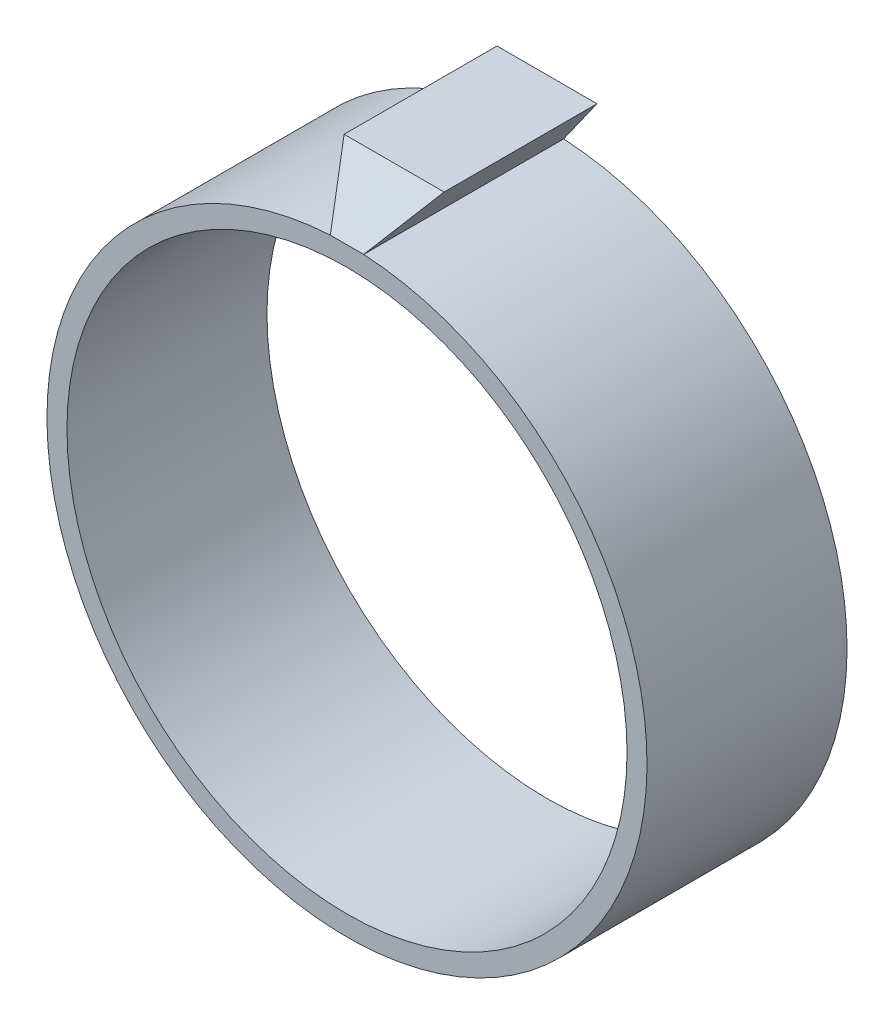
ISO-10303-21;
HEADER;
FILE_DESCRIPTION(('STEP AP214'),'2;1');
FILE_NAME('part.step','',(''),(''),'','','');
FILE_SCHEMA(('AUTOMOTIVE_DESIGN { 1 0 10303 214 1 1 1 1 }'));
ENDSEC;
DATA;
#1=APPLICATION_CONTEXT('core data for automotive mechanical design processes');
#2=APPLICATION_PROTOCOL_DEFINITION('international standard','automotive_design',2000,#1);
#3=PRODUCT_CONTEXT('',#1,'mechanical');
#4=PRODUCT('Part','Part','',(#3));
#5=PRODUCT_RELATED_PRODUCT_CATEGORY('part','',(#4));
#6=PRODUCT_DEFINITION_FORMATION('','',#4);
#7=PRODUCT_DEFINITION_CONTEXT('part definition',#1,'design');
#8=PRODUCT_DEFINITION('design','',#6,#7);
#9=PRODUCT_DEFINITION_SHAPE('','',#8);
#10=(LENGTH_UNIT() NAMED_UNIT(*) SI_UNIT(.MILLI.,.METRE.));
#11=(NAMED_UNIT(*) PLANE_ANGLE_UNIT() SI_UNIT($,.RADIAN.));
#12=(NAMED_UNIT(*) SI_UNIT($,.STERADIAN.) SOLID_ANGLE_UNIT());
#13=UNCERTAINTY_MEASURE_WITH_UNIT(LENGTH_MEASURE(1.E-05),#10,'distance_accuracy_value','');
#14=(GEOMETRIC_REPRESENTATION_CONTEXT(3) GLOBAL_UNCERTAINTY_ASSIGNED_CONTEXT((#13)) GLOBAL_UNIT_ASSIGNED_CONTEXT((#10,
#11,#12)) REPRESENTATION_CONTEXT('',''));
#15=CARTESIAN_POINT('',(0.,0.,0.));
#16=DIRECTION('',(0.,0.,1.));
#17=DIRECTION('',(1.,0.,0.));
#18=AXIS2_PLACEMENT_3D('',#15,#16,#17);
#19=CARTESIAN_POINT('',(0.,0.,30.));
#20=DIRECTION('',(0.,0.,-1.));
#21=DIRECTION('',(-1.,0.,0.));
#22=AXIS2_PLACEMENT_3D('',#19,#20,#21);
#23=CYLINDRICAL_SURFACE('',#22,45.);
#24=CARTESIAN_POINT('',(0.,0.,0.));
#25=DIRECTION('',(0.,0.,1.));
#26=DIRECTION('',(1.,0.,0.));
#27=AXIS2_PLACEMENT_3D('',#24,#25,#26);
#28=CIRCLE('',#27,45.);
#29=CARTESIAN_POINT('',(2.5,44.9305018890286,0.));
#30=VERTEX_POINT('',#29);
#31=CARTESIAN_POINT('',(-2.5,44.9305018890286,0.));
#32=VERTEX_POINT('',#31);
#33=EDGE_CURVE('E83',#30,#32,#28,.F.);
#34=ORIENTED_EDGE('',*,*,#33,.F.);
#35=DIRECTION('',(0.,0.,-1.));
#36=VECTOR('',#35,1.);
#37=CARTESIAN_POINT('',(2.5,44.9305018890286,30.));
#38=LINE('',#37,#36);
#39=CARTESIAN_POINT('',(2.5,44.9305018890286,30.));
#40=VERTEX_POINT('',#39);
#41=EDGE_CURVE('E11',#40,#30,#38,.T.);
#42=ORIENTED_EDGE('',*,*,#41,.F.);
#43=CARTESIAN_POINT('',(0.,0.,30.));
#44=DIRECTION('',(0.,0.,1.));
#45=DIRECTION('',(1.,0.,0.));
#46=AXIS2_PLACEMENT_3D('',#43,#44,#45);
#47=CIRCLE('',#46,45.);
#48=CARTESIAN_POINT('',(-2.5,44.9305018890286,30.));
#49=VERTEX_POINT('',#48);
#50=EDGE_CURVE('E96',#40,#49,#47,.F.);
#51=ORIENTED_EDGE('',*,*,#50,.T.);
#52=DIRECTION('',(0.,0.,-1.));
#53=VECTOR('',#52,1.);
#54=CARTESIAN_POINT('',(-2.5,44.9305018890286,30.));
#55=LINE('',#54,#53);
#56=EDGE_CURVE('E74',#49,#32,#55,.T.);
#57=ORIENTED_EDGE('',*,*,#56,.T.);
#58=EDGE_LOOP('',(#34,#42,#51,#57));
#59=FACE_BOUND('',#58,.T.);
#60=ADVANCED_FACE('F34',(#59),#23,.T.);
#61=CARTESIAN_POINT('',(-19.5155887901432,13.8026692162604,30.));
#62=DIRECTION('',(0.816436149697724,-0.577435722368088,0.));
#63=DIRECTION('',(0.577435722368088,0.816436149697724,0.));
#64=AXIS2_PLACEMENT_3D('',#61,#62,#63);
#65=PLANE('',#64);
#66=DIRECTION('',(0.447293029124119,0.632427444888729,-0.632427444888727));
#67=VECTOR('',#66,1.);
#68=CARTESIAN_POINT('',(5.22530951095448,48.7838159769296,26.146685912099));
#69=LINE('',#68,#67);
#70=CARTESIAN_POINT('',(7.5,52.,22.9305018890286));
#71=VERTEX_POINT('',#70);
#72=EDGE_CURVE('E110',#40,#71,#69,.T.);
#73=ORIENTED_EDGE('',*,*,#72,.F.);
#74=ORIENTED_EDGE('',*,*,#41,.T.);
#75=DIRECTION('',(-0.577435722368088,-0.816436149697724,0.));
#76=VECTOR('',#75,1.);
#77=CARTESIAN_POINT('',(-19.5155887901432,13.8026692162604,0.));
#78=LINE('',#77,#76);
#79=CARTESIAN_POINT('',(7.5,52.,0.));
#80=VERTEX_POINT('',#79);
#81=EDGE_CURVE('E89',#80,#30,#78,.T.);
#82=ORIENTED_EDGE('',*,*,#81,.F.);
#83=DIRECTION('',(0.,0.,-1.));
#84=VECTOR('',#83,1.);
#85=CARTESIAN_POINT('',(7.5,52.,30.));
#86=LINE('',#85,#84);
#87=EDGE_CURVE('E42',#71,#80,#86,.T.);
#88=ORIENTED_EDGE('',*,*,#87,.F.);
#89=EDGE_LOOP('',(#73,#74,#82,#88));
#90=FACE_BOUND('',#89,.T.);
#91=ADVANCED_FACE('F120',(#90),#65,.T.);
#92=CARTESIAN_POINT('',(0.,52.,30.));
#93=DIRECTION('',(0.,1.,0.));
#94=DIRECTION('',(0.,0.,1.));
#95=AXIS2_PLACEMENT_3D('',#92,#93,#94);
#96=PLANE('',#95);
#97=DIRECTION('',(1.,0.,0.));
#98=VECTOR('',#97,1.);
#99=CARTESIAN_POINT('',(-16.1217081771128,52.,22.9305018890286));
#100=LINE('',#99,#98);
#101=CARTESIAN_POINT('',(-7.5,52.,22.9305018890286));
#102=VERTEX_POINT('',#101);
#103=EDGE_CURVE('E106',#102,#71,#100,.T.);
#104=ORIENTED_EDGE('',*,*,#103,.T.);
#105=ORIENTED_EDGE('',*,*,#87,.T.);
#106=DIRECTION('',(1.,0.,0.));
#107=VECTOR('',#106,1.);
#108=CARTESIAN_POINT('',(0.,52.,0.));
#109=LINE('',#108,#107);
#110=CARTESIAN_POINT('',(-7.5,52.,0.));
#111=VERTEX_POINT('',#110);
#112=EDGE_CURVE('E81',#111,#80,#109,.T.);
#113=ORIENTED_EDGE('',*,*,#112,.F.);
#114=DIRECTION('',(0.,0.,-1.));
#115=VECTOR('',#114,1.);
#116=CARTESIAN_POINT('',(-7.5,52.,30.));
#117=LINE('',#116,#115);
#118=EDGE_CURVE('E65',#102,#111,#117,.T.);
#119=ORIENTED_EDGE('',*,*,#118,.F.);
#120=EDGE_LOOP('',(#104,#105,#113,#119));
#121=FACE_BOUND('',#120,.T.);
#122=ADVANCED_FACE('F86',(#121),#96,.T.);
#123=CARTESIAN_POINT('',(19.5155887901432,13.8026692162604,30.));
#124=DIRECTION('',(0.816436149697724,0.577435722368088,0.));
#125=DIRECTION('',(-0.577435722368088,0.816436149697724,0.));
#126=AXIS2_PLACEMENT_3D('',#123,#124,#125);
#127=PLANE('',#126);
#128=ORIENTED_EDGE('',*,*,#56,.F.);
#129=DIRECTION('',(0.447293029124119,-0.632427444888729,0.632427444888727));
#130=VECTOR('',#129,1.);
#131=CARTESIAN_POINT('',(-5.22530951095448,48.7838159769296,26.146685912099));
#132=LINE('',#131,#130);
#133=EDGE_CURVE('E49',#102,#49,#132,.T.);
#134=ORIENTED_EDGE('',*,*,#133,.F.);
#135=ORIENTED_EDGE('',*,*,#118,.T.);
#136=DIRECTION('',(0.577435722368088,-0.816436149697724,0.));
#137=VECTOR('',#136,1.);
#138=CARTESIAN_POINT('',(19.5155887901432,13.8026692162604,0.));
#139=LINE('',#138,#137);
#140=EDGE_CURVE('E69',#111,#32,#139,.T.);
#141=ORIENTED_EDGE('',*,*,#140,.T.);
#142=EDGE_LOOP('',(#128,#134,#135,#141));
#143=FACE_BOUND('',#142,.T.);
#144=ADVANCED_FACE('F68',(#143),#127,.F.);
#145=CARTESIAN_POINT('',(0.,0.,30.));
#146=DIRECTION('',(0.,0.,-1.));
#147=DIRECTION('',(-1.,0.,0.));
#148=AXIS2_PLACEMENT_3D('',#145,#146,#147);
#149=CYLINDRICAL_SURFACE('',#148,42.);
#150=CARTESIAN_POINT('',(0.,0.,30.));
#151=DIRECTION('',(0.,0.,1.));
#152=DIRECTION('',(1.,0.,0.));
#153=AXIS2_PLACEMENT_3D('',#150,#151,#152);
#154=CIRCLE('',#153,42.);
#155=CARTESIAN_POINT('',(42.,0.,30.));
#156=VERTEX_POINT('',#155);
#157=EDGE_CURVE('E97',#156,#156,#154,.T.);
#158=ORIENTED_EDGE('',*,*,#157,.T.);
#159=EDGE_LOOP('',(#158));
#160=FACE_BOUND('',#159,.T.);
#161=CARTESIAN_POINT('',(0.,0.,0.));
#162=DIRECTION('',(0.,0.,1.));
#163=DIRECTION('',(1.,0.,0.));
#164=AXIS2_PLACEMENT_3D('',#161,#162,#163);
#165=CIRCLE('',#164,42.);
#166=CARTESIAN_POINT('',(42.,0.,0.));
#167=VERTEX_POINT('',#166);
#168=EDGE_CURVE('E84',#167,#167,#165,.T.);
#169=ORIENTED_EDGE('',*,*,#168,.F.);
#170=EDGE_LOOP('',(#169));
#171=FACE_BOUND('',#170,.T.);
#172=ADVANCED_FACE('F133',(#160,#171),#149,.F.);
#173=CARTESIAN_POINT('',(0.,0.,30.));
#174=DIRECTION('',(0.,0.,1.));
#175=DIRECTION('',(1.,0.,0.));
#176=AXIS2_PLACEMENT_3D('',#173,#174,#175);
#177=PLANE('',#176);
#178=DIRECTION('',(1.,0.,0.));
#179=VECTOR('',#178,1.);
#180=CARTESIAN_POINT('',(-16.1217081771128,44.9305018890286,30.));
#181=LINE('',#180,#179);
#182=EDGE_CURVE('E107',#49,#40,#181,.T.);
#183=ORIENTED_EDGE('',*,*,#182,.F.);
#184=ORIENTED_EDGE('',*,*,#50,.F.);
#185=EDGE_LOOP('',(#183,#184));
#186=FACE_BOUND('',#185,.T.);
#187=ORIENTED_EDGE('',*,*,#157,.F.);
#188=EDGE_LOOP('',(#187));
#189=FACE_BOUND('',#188,.T.);
#190=ADVANCED_FACE('F136',(#186,#189),#177,.T.);
#191=CARTESIAN_POINT('',(0.,0.,0.));
#192=DIRECTION('',(0.,0.,1.));
#193=DIRECTION('',(1.,0.,0.));
#194=AXIS2_PLACEMENT_3D('',#191,#192,#193);
#195=PLANE('',#194);
#196=ORIENTED_EDGE('',*,*,#33,.T.);
#197=ORIENTED_EDGE('',*,*,#140,.F.);
#198=ORIENTED_EDGE('',*,*,#112,.T.);
#199=ORIENTED_EDGE('',*,*,#81,.T.);
#200=EDGE_LOOP('',(#196,#197,#198,#199));
#201=FACE_BOUND('',#200,.T.);
#202=ORIENTED_EDGE('',*,*,#168,.T.);
#203=EDGE_LOOP('',(#202));
#204=FACE_BOUND('',#203,.T.);
#205=ADVANCED_FACE('F78',(#201,#204),#195,.F.);
#206=CARTESIAN_POINT('',(-16.1217081771128,44.9305018890286,30.));
#207=DIRECTION('',(0.,-0.707106781186546,-0.707106781186549));
#208=DIRECTION('',(0.,0.707106781186549,-0.707106781186546));
#209=AXIS2_PLACEMENT_3D('',#206,#207,#208);
#210=PLANE('',#209);
#211=ORIENTED_EDGE('',*,*,#133,.T.);
#212=ORIENTED_EDGE('',*,*,#182,.T.);
#213=ORIENTED_EDGE('',*,*,#72,.T.);
#214=ORIENTED_EDGE('',*,*,#103,.F.);
#215=EDGE_LOOP('',(#211,#212,#213,#214));
#216=FACE_BOUND('',#215,.T.);
#217=ADVANCED_FACE('F115',(#216),#210,.F.);
#218=CLOSED_SHELL('',(#60,#91,#122,#144,#172,#190,#205,#217));
#219=MANIFOLD_SOLID_BREP('B2',#218);
#220=ADVANCED_BREP_SHAPE_REPRESENTATION('',(#18,#219),#14);
#221=SHAPE_DEFINITION_REPRESENTATION(#9,#220);
ENDSEC;
END-ISO-10303-21;
